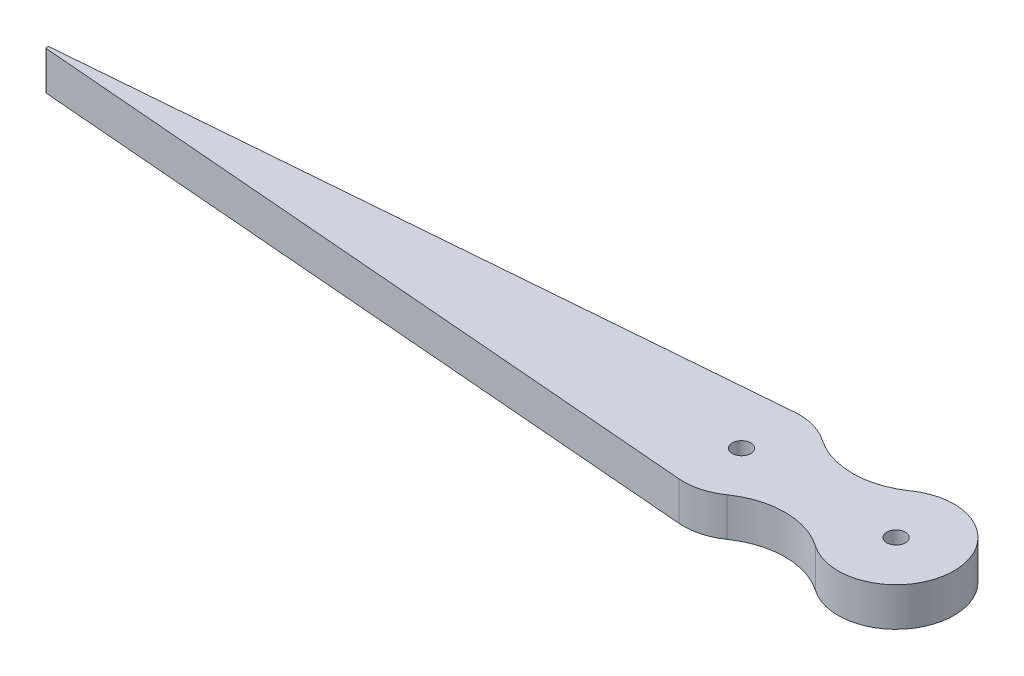
ISO-10303-21;
HEADER;
FILE_DESCRIPTION(('STEP AP214'),'2;1');
FILE_NAME('part.step','',(''),(''),'','','');
FILE_SCHEMA(('AUTOMOTIVE_DESIGN { 1 0 10303 214 1 1 1 1 }'));
ENDSEC;
DATA;
#1=APPLICATION_CONTEXT('core data for automotive mechanical design processes');
#2=APPLICATION_PROTOCOL_DEFINITION('international standard','automotive_design',2000,#1);
#3=PRODUCT_CONTEXT('',#1,'mechanical');
#4=PRODUCT('Part','Part','',(#3));
#5=PRODUCT_RELATED_PRODUCT_CATEGORY('part','',(#4));
#6=PRODUCT_DEFINITION_FORMATION('','',#4);
#7=PRODUCT_DEFINITION_CONTEXT('part definition',#1,'design');
#8=PRODUCT_DEFINITION('design','',#6,#7);
#9=PRODUCT_DEFINITION_SHAPE('','',#8);
#10=(LENGTH_UNIT() NAMED_UNIT(*) SI_UNIT(.MILLI.,.METRE.));
#11=(NAMED_UNIT(*) PLANE_ANGLE_UNIT() SI_UNIT($,.RADIAN.));
#12=(NAMED_UNIT(*) SI_UNIT($,.STERADIAN.) SOLID_ANGLE_UNIT());
#13=UNCERTAINTY_MEASURE_WITH_UNIT(LENGTH_MEASURE(1.E-05),#10,'distance_accuracy_value','');
#14=(GEOMETRIC_REPRESENTATION_CONTEXT(3) GLOBAL_UNCERTAINTY_ASSIGNED_CONTEXT((#13)) GLOBAL_UNIT_ASSIGNED_CONTEXT((#10,
#11,#12)) REPRESENTATION_CONTEXT('',''));
#15=CARTESIAN_POINT('',(0.,0.,0.));
#16=DIRECTION('',(0.,0.,1.));
#17=DIRECTION('',(1.,0.,0.));
#18=AXIS2_PLACEMENT_3D('',#15,#16,#17);
#19=CARTESIAN_POINT('',(0.,6.35,0.));
#20=DIRECTION('',(0.,1.,0.));
#21=DIRECTION('',(0.,0.,1.));
#22=AXIS2_PLACEMENT_3D('',#19,#20,#21);
#23=PLANE('',#22);
#24=CARTESIAN_POINT('',(0.,6.35,0.));
#25=DIRECTION('',(0.,1.,0.));
#26=DIRECTION('',(0.,0.,1.));
#27=AXIS2_PLACEMENT_3D('',#24,#25,#26);
#28=CIRCLE('',#27,1.524);
#29=CARTESIAN_POINT('',(0.,6.35,1.524));
#30=VERTEX_POINT('',#29);
#31=EDGE_CURVE('E150',#30,#30,#28,.T.);
#32=ORIENTED_EDGE('',*,*,#31,.F.);
#33=EDGE_LOOP('',(#32));
#34=FACE_BOUND('',#33,.T.);
#35=DIRECTION('',(-0.996685329508931,0.,0.081353266324555));
#36=VECTOR('',#35,1.);
#37=CARTESIAN_POINT('',(-0.774889861741387,6.35,-9.49342776357256));
#38=LINE('',#37,#36);
#39=CARTESIAN_POINT('',(-0.774889861741387,6.35,-9.49342776357256));
#40=VERTEX_POINT('',#39);
#41=CARTESIAN_POINT('',(-113.980439640964,6.35,-0.253158073695268));
#42=VERTEX_POINT('',#41);
#43=EDGE_CURVE('E95',#40,#42,#38,.T.);
#44=ORIENTED_EDGE('',*,*,#43,.T.);
#45=CARTESIAN_POINT('',(-113.959775911317,6.35,0.));
#46=DIRECTION('',(0.,1.,0.));
#47=DIRECTION('',(0.,0.,1.));
#48=AXIS2_PLACEMENT_3D('',#45,#46,#47);
#49=CIRCLE('',#48,0.254);
#50=CARTESIAN_POINT('',(-113.980439640964,6.35,0.253158073695268));
#51=VERTEX_POINT('',#50);
#52=EDGE_CURVE('E11',#42,#51,#49,.T.);
#53=ORIENTED_EDGE('',*,*,#52,.T.);
#54=DIRECTION('',(0.996685329508931,0.,0.081353266324555));
#55=VECTOR('',#54,1.);
#56=CARTESIAN_POINT('',(-117.081961552723,6.35,0.));
#57=LINE('',#56,#55);
#58=CARTESIAN_POINT('',(-0.774889861741387,6.35,9.49342776357256));
#59=VERTEX_POINT('',#58);
#60=EDGE_CURVE('E103',#51,#59,#57,.T.);
#61=ORIENTED_EDGE('',*,*,#60,.T.);
#62=CARTESIAN_POINT('',(0.,6.35,0.));
#63=DIRECTION('',(0.,1.,0.));
#64=DIRECTION('',(0.,0.,1.));
#65=AXIS2_PLACEMENT_3D('',#62,#63,#64);
#66=CIRCLE('',#65,9.525);
#67=CARTESIAN_POINT('',(5.44285714285714,6.35,7.81670845832496));
#68=VERTEX_POINT('',#67);
#69=EDGE_CURVE('E156',#59,#68,#66,.T.);
#70=ORIENTED_EDGE('',*,*,#69,.T.);
#71=CARTESIAN_POINT('',(12.7,6.35,18.2389864027582));
#72=DIRECTION('',(0.,-1.,0.));
#73=DIRECTION('',(0.,0.,1.));
#74=AXIS2_PLACEMENT_3D('',#71,#72,#73);
#75=CIRCLE('',#74,12.7);
#76=CARTESIAN_POINT('',(19.9571428571429,6.35,7.81670845832496));
#77=VERTEX_POINT('',#76);
#78=EDGE_CURVE('E154',#68,#77,#75,.T.);
#79=ORIENTED_EDGE('',*,*,#78,.T.);
#80=CARTESIAN_POINT('',(25.4,6.35,0.));
#81=DIRECTION('',(0.,1.,0.));
#82=DIRECTION('',(0.,0.,1.));
#83=AXIS2_PLACEMENT_3D('',#80,#81,#82);
#84=CIRCLE('',#83,9.525);
#85=CARTESIAN_POINT('',(19.9571428571429,6.35,-7.81670845832496));
#86=VERTEX_POINT('',#85);
#87=EDGE_CURVE('E152',#77,#86,#84,.T.);
#88=ORIENTED_EDGE('',*,*,#87,.T.);
#89=CARTESIAN_POINT('',(12.7,6.35,-18.2389864027582));
#90=DIRECTION('',(0.,-1.,0.));
#91=DIRECTION('',(0.,0.,1.));
#92=AXIS2_PLACEMENT_3D('',#89,#90,#91);
#93=CIRCLE('',#92,12.7);
#94=CARTESIAN_POINT('',(5.44285714285714,6.35,-7.81670845832496));
#95=VERTEX_POINT('',#94);
#96=EDGE_CURVE('E109',#86,#95,#93,.T.);
#97=ORIENTED_EDGE('',*,*,#96,.T.);
#98=CARTESIAN_POINT('',(0.,6.35,0.));
#99=DIRECTION('',(0.,1.,0.));
#100=DIRECTION('',(0.,0.,1.));
#101=AXIS2_PLACEMENT_3D('',#98,#99,#100);
#102=CIRCLE('',#101,9.525);
#103=EDGE_CURVE('E104',#95,#40,#102,.T.);
#104=ORIENTED_EDGE('',*,*,#103,.T.);
#105=EDGE_LOOP('',(#44,#53,#61,#70,#79,#88,#97,#104));
#106=FACE_BOUND('',#105,.T.);
#107=CARTESIAN_POINT('',(25.4,6.35,0.));
#108=DIRECTION('',(0.,1.,0.));
#109=DIRECTION('',(0.,0.,1.));
#110=AXIS2_PLACEMENT_3D('',#107,#108,#109);
#111=CIRCLE('',#110,1.524);
#112=CARTESIAN_POINT('',(25.4,6.35,1.524));
#113=VERTEX_POINT('',#112);
#114=EDGE_CURVE('E162',#113,#113,#111,.T.);
#115=ORIENTED_EDGE('',*,*,#114,.F.);
#116=EDGE_LOOP('',(#115));
#117=FACE_BOUND('',#116,.T.);
#118=ADVANCED_FACE('F34',(#34,#106,#117),#23,.T.);
#119=CARTESIAN_POINT('',(0.,0.,0.));
#120=DIRECTION('',(0.,1.,0.));
#121=DIRECTION('',(0.,0.,1.));
#122=AXIS2_PLACEMENT_3D('',#119,#120,#121);
#123=PLANE('',#122);
#124=DIRECTION('',(0.996685329508931,0.,0.081353266324555));
#125=VECTOR('',#124,1.);
#126=CARTESIAN_POINT('',(-117.081961552723,0.,0.));
#127=LINE('',#126,#125);
#128=CARTESIAN_POINT('',(-113.980439640964,0.,0.253158073695268));
#129=VERTEX_POINT('',#128);
#130=CARTESIAN_POINT('',(-0.774889861741387,0.,9.49342776357256));
#131=VERTEX_POINT('',#130);
#132=EDGE_CURVE('E145',#129,#131,#127,.T.);
#133=ORIENTED_EDGE('',*,*,#132,.F.);
#134=CARTESIAN_POINT('',(-113.959775911317,0.,0.));
#135=DIRECTION('',(0.,1.,0.));
#136=DIRECTION('',(0.,0.,1.));
#137=AXIS2_PLACEMENT_3D('',#134,#135,#136);
#138=CIRCLE('',#137,0.254);
#139=CARTESIAN_POINT('',(-113.980439640964,0.,-0.253158073695268));
#140=VERTEX_POINT('',#139);
#141=EDGE_CURVE('E56',#129,#140,#138,.F.);
#142=ORIENTED_EDGE('',*,*,#141,.T.);
#143=DIRECTION('',(-0.996685329508931,0.,0.081353266324555));
#144=VECTOR('',#143,1.);
#145=CARTESIAN_POINT('',(-0.774889861741387,0.,-9.49342776357256));
#146=LINE('',#145,#144);
#147=CARTESIAN_POINT('',(-0.774889861741387,0.,-9.49342776357256));
#148=VERTEX_POINT('',#147);
#149=EDGE_CURVE('E147',#148,#140,#146,.T.);
#150=ORIENTED_EDGE('',*,*,#149,.F.);
#151=CARTESIAN_POINT('',(0.,0.,0.));
#152=DIRECTION('',(0.,1.,0.));
#153=DIRECTION('',(0.,0.,1.));
#154=AXIS2_PLACEMENT_3D('',#151,#152,#153);
#155=CIRCLE('',#154,9.525);
#156=CARTESIAN_POINT('',(5.44285714285714,0.,-7.81670845832496));
#157=VERTEX_POINT('',#156);
#158=EDGE_CURVE('E117',#157,#148,#155,.T.);
#159=ORIENTED_EDGE('',*,*,#158,.F.);
#160=CARTESIAN_POINT('',(12.7,0.,-18.2389864027582));
#161=DIRECTION('',(0.,-1.,0.));
#162=DIRECTION('',(0.,0.,1.));
#163=AXIS2_PLACEMENT_3D('',#160,#161,#162);
#164=CIRCLE('',#163,12.7);
#165=CARTESIAN_POINT('',(19.9571428571429,0.,-7.81670845832496));
#166=VERTEX_POINT('',#165);
#167=EDGE_CURVE('E113',#166,#157,#164,.T.);
#168=ORIENTED_EDGE('',*,*,#167,.F.);
#169=CARTESIAN_POINT('',(25.4,0.,0.));
#170=DIRECTION('',(0.,1.,0.));
#171=DIRECTION('',(0.,0.,1.));
#172=AXIS2_PLACEMENT_3D('',#169,#170,#171);
#173=CIRCLE('',#172,9.525);
#174=CARTESIAN_POINT('',(19.9571428571429,0.,7.81670845832496));
#175=VERTEX_POINT('',#174);
#176=EDGE_CURVE('E139',#175,#166,#173,.T.);
#177=ORIENTED_EDGE('',*,*,#176,.F.);
#178=CARTESIAN_POINT('',(12.7,0.,18.2389864027582));
#179=DIRECTION('',(0.,-1.,0.));
#180=DIRECTION('',(0.,0.,1.));
#181=AXIS2_PLACEMENT_3D('',#178,#179,#180);
#182=CIRCLE('',#181,12.7);
#183=CARTESIAN_POINT('',(5.44285714285714,0.,7.81670845832496));
#184=VERTEX_POINT('',#183);
#185=EDGE_CURVE('E141',#184,#175,#182,.T.);
#186=ORIENTED_EDGE('',*,*,#185,.F.);
#187=CARTESIAN_POINT('',(0.,0.,0.));
#188=DIRECTION('',(0.,1.,0.));
#189=DIRECTION('',(0.,0.,1.));
#190=AXIS2_PLACEMENT_3D('',#187,#188,#189);
#191=CIRCLE('',#190,9.525);
#192=EDGE_CURVE('E143',#131,#184,#191,.T.);
#193=ORIENTED_EDGE('',*,*,#192,.F.);
#194=EDGE_LOOP('',(#133,#142,#150,#159,#168,#177,#186,#193));
#195=FACE_BOUND('',#194,.T.);
#196=CARTESIAN_POINT('',(0.,0.,0.));
#197=DIRECTION('',(0.,1.,0.));
#198=DIRECTION('',(0.,0.,1.));
#199=AXIS2_PLACEMENT_3D('',#196,#197,#198);
#200=CIRCLE('',#199,1.524);
#201=CARTESIAN_POINT('',(0.,0.,1.524));
#202=VERTEX_POINT('',#201);
#203=EDGE_CURVE('E159',#202,#202,#200,.T.);
#204=ORIENTED_EDGE('',*,*,#203,.T.);
#205=EDGE_LOOP('',(#204));
#206=FACE_BOUND('',#205,.T.);
#207=CARTESIAN_POINT('',(25.4,0.,0.));
#208=DIRECTION('',(0.,1.,0.));
#209=DIRECTION('',(0.,0.,1.));
#210=AXIS2_PLACEMENT_3D('',#207,#208,#209);
#211=CIRCLE('',#210,1.524);
#212=CARTESIAN_POINT('',(25.4,0.,1.524));
#213=VERTEX_POINT('',#212);
#214=EDGE_CURVE('E165',#213,#213,#211,.T.);
#215=ORIENTED_EDGE('',*,*,#214,.T.);
#216=EDGE_LOOP('',(#215));
#217=FACE_BOUND('',#216,.T.);
#218=ADVANCED_FACE('F174',(#195,#206,#217),#123,.F.);
#219=CARTESIAN_POINT('',(0.,6.35,0.));
#220=DIRECTION('',(0.,-1.,0.));
#221=DIRECTION('',(0.,0.,-1.));
#222=AXIS2_PLACEMENT_3D('',#219,#220,#221);
#223=CYLINDRICAL_SURFACE('',#222,9.525);
#224=ORIENTED_EDGE('',*,*,#158,.T.);
#225=DIRECTION('',(0.,-1.,0.));
#226=VECTOR('',#225,1.);
#227=CARTESIAN_POINT('',(-0.774889861741387,6.35,-9.49342776357256));
#228=LINE('',#227,#226);
#229=EDGE_CURVE('E99',#40,#148,#228,.T.);
#230=ORIENTED_EDGE('',*,*,#229,.F.);
#231=ORIENTED_EDGE('',*,*,#103,.F.);
#232=DIRECTION('',(0.,-1.,0.));
#233=VECTOR('',#232,1.);
#234=CARTESIAN_POINT('',(5.44285714285714,6.35,-7.81670845832496));
#235=LINE('',#234,#233);
#236=EDGE_CURVE('E136',#95,#157,#235,.T.);
#237=ORIENTED_EDGE('',*,*,#236,.T.);
#238=EDGE_LOOP('',(#224,#230,#231,#237));
#239=FACE_BOUND('',#238,.T.);
#240=ADVANCED_FACE('F115',(#239),#223,.T.);
#241=CARTESIAN_POINT('',(-0.774889861741387,6.35,-9.49342776357256));
#242=DIRECTION('',(0.081353266324555,0.,0.996685329508931));
#243=DIRECTION('',(0.996685329508931,0.,-0.081353266324555));
#244=AXIS2_PLACEMENT_3D('',#241,#242,#243);
#245=PLANE('',#244);
#246=ORIENTED_EDGE('',*,*,#149,.T.);
#247=DIRECTION('',(0.,-1.,0.));
#248=VECTOR('',#247,1.);
#249=CARTESIAN_POINT('',(-113.980439640964,6.35,-0.253158073695268));
#250=LINE('',#249,#248);
#251=EDGE_CURVE('E42',#140,#42,#250,.F.);
#252=ORIENTED_EDGE('',*,*,#251,.T.);
#253=ORIENTED_EDGE('',*,*,#43,.F.);
#254=ORIENTED_EDGE('',*,*,#229,.T.);
#255=EDGE_LOOP('',(#246,#252,#253,#254));
#256=FACE_BOUND('',#255,.T.);
#257=ADVANCED_FACE('F97',(#256),#245,.F.);
#258=CARTESIAN_POINT('',(-117.081961552723,6.35,0.));
#259=DIRECTION('',(0.081353266324555,0.,-0.996685329508931));
#260=DIRECTION('',(-0.996685329508931,0.,-0.081353266324555));
#261=AXIS2_PLACEMENT_3D('',#258,#259,#260);
#262=PLANE('',#261);
#263=ORIENTED_EDGE('',*,*,#60,.F.);
#264=DIRECTION('',(0.,-1.,0.));
#265=VECTOR('',#264,1.);
#266=CARTESIAN_POINT('',(-113.980439640964,6.35,0.253158073695268));
#267=LINE('',#266,#265);
#268=EDGE_CURVE('E118',#51,#129,#267,.T.);
#269=ORIENTED_EDGE('',*,*,#268,.T.);
#270=ORIENTED_EDGE('',*,*,#132,.T.);
#271=DIRECTION('',(0.,-1.,0.));
#272=VECTOR('',#271,1.);
#273=CARTESIAN_POINT('',(-0.774889861741387,6.35,9.49342776357256));
#274=LINE('',#273,#272);
#275=EDGE_CURVE('E119',#59,#131,#274,.T.);
#276=ORIENTED_EDGE('',*,*,#275,.F.);
#277=EDGE_LOOP('',(#263,#269,#270,#276));
#278=FACE_BOUND('',#277,.T.);
#279=ADVANCED_FACE('F201',(#278),#262,.F.);
#280=CARTESIAN_POINT('',(0.,6.35,0.));
#281=DIRECTION('',(0.,-1.,0.));
#282=DIRECTION('',(0.,0.,-1.));
#283=AXIS2_PLACEMENT_3D('',#280,#281,#282);
#284=CYLINDRICAL_SURFACE('',#283,9.525);
#285=ORIENTED_EDGE('',*,*,#192,.T.);
#286=DIRECTION('',(0.,-1.,0.));
#287=VECTOR('',#286,1.);
#288=CARTESIAN_POINT('',(5.44285714285714,6.35,7.81670845832496));
#289=LINE('',#288,#287);
#290=EDGE_CURVE('E124',#68,#184,#289,.T.);
#291=ORIENTED_EDGE('',*,*,#290,.F.);
#292=ORIENTED_EDGE('',*,*,#69,.F.);
#293=ORIENTED_EDGE('',*,*,#275,.T.);
#294=EDGE_LOOP('',(#285,#291,#292,#293));
#295=FACE_BOUND('',#294,.T.);
#296=ADVANCED_FACE('F197',(#295),#284,.T.);
#297=CARTESIAN_POINT('',(12.7,6.35,18.2389864027582));
#298=DIRECTION('',(0.,-1.,0.));
#299=DIRECTION('',(0.,0.,-1.));
#300=AXIS2_PLACEMENT_3D('',#297,#298,#299);
#301=CYLINDRICAL_SURFACE('',#300,12.7);
#302=ORIENTED_EDGE('',*,*,#185,.T.);
#303=DIRECTION('',(0.,-1.,0.));
#304=VECTOR('',#303,1.);
#305=CARTESIAN_POINT('',(19.9571428571429,6.35,7.81670845832496));
#306=LINE('',#305,#304);
#307=EDGE_CURVE('E130',#77,#175,#306,.T.);
#308=ORIENTED_EDGE('',*,*,#307,.F.);
#309=ORIENTED_EDGE('',*,*,#78,.F.);
#310=ORIENTED_EDGE('',*,*,#290,.T.);
#311=EDGE_LOOP('',(#302,#308,#309,#310));
#312=FACE_BOUND('',#311,.T.);
#313=ADVANCED_FACE('F193',(#312),#301,.F.);
#314=CARTESIAN_POINT('',(25.4,6.35,0.));
#315=DIRECTION('',(0.,-1.,0.));
#316=DIRECTION('',(0.,0.,-1.));
#317=AXIS2_PLACEMENT_3D('',#314,#315,#316);
#318=CYLINDRICAL_SURFACE('',#317,9.525);
#319=ORIENTED_EDGE('',*,*,#176,.T.);
#320=DIRECTION('',(0.,-1.,0.));
#321=VECTOR('',#320,1.);
#322=CARTESIAN_POINT('',(19.9571428571429,6.35,-7.81670845832496));
#323=LINE('',#322,#321);
#324=EDGE_CURVE('E133',#86,#166,#323,.T.);
#325=ORIENTED_EDGE('',*,*,#324,.F.);
#326=ORIENTED_EDGE('',*,*,#87,.F.);
#327=ORIENTED_EDGE('',*,*,#307,.T.);
#328=EDGE_LOOP('',(#319,#325,#326,#327));
#329=FACE_BOUND('',#328,.T.);
#330=ADVANCED_FACE('F189',(#329),#318,.T.);
#331=CARTESIAN_POINT('',(12.7,6.35,-18.2389864027582));
#332=DIRECTION('',(0.,-1.,0.));
#333=DIRECTION('',(0.,0.,-1.));
#334=AXIS2_PLACEMENT_3D('',#331,#332,#333);
#335=CYLINDRICAL_SURFACE('',#334,12.7);
#336=ORIENTED_EDGE('',*,*,#167,.T.);
#337=ORIENTED_EDGE('',*,*,#236,.F.);
#338=ORIENTED_EDGE('',*,*,#96,.F.);
#339=ORIENTED_EDGE('',*,*,#324,.T.);
#340=EDGE_LOOP('',(#336,#337,#338,#339));
#341=FACE_BOUND('',#340,.T.);
#342=ADVANCED_FACE('F186',(#341),#335,.F.);
#343=CARTESIAN_POINT('',(0.,6.35,0.));
#344=DIRECTION('',(0.,-1.,0.));
#345=DIRECTION('',(0.,0.,-1.));
#346=AXIS2_PLACEMENT_3D('',#343,#344,#345);
#347=CYLINDRICAL_SURFACE('',#346,1.524);
#348=ORIENTED_EDGE('',*,*,#31,.T.);
#349=EDGE_LOOP('',(#348));
#350=FACE_BOUND('',#349,.T.);
#351=ORIENTED_EDGE('',*,*,#203,.F.);
#352=EDGE_LOOP('',(#351));
#353=FACE_BOUND('',#352,.T.);
#354=ADVANCED_FACE('F183',(#350,#353),#347,.F.);
#355=CARTESIAN_POINT('',(25.4,6.35,0.));
#356=DIRECTION('',(0.,-1.,0.));
#357=DIRECTION('',(0.,0.,-1.));
#358=AXIS2_PLACEMENT_3D('',#355,#356,#357);
#359=CYLINDRICAL_SURFACE('',#358,1.524);
#360=ORIENTED_EDGE('',*,*,#114,.T.);
#361=EDGE_LOOP('',(#360));
#362=FACE_BOUND('',#361,.T.);
#363=ORIENTED_EDGE('',*,*,#214,.F.);
#364=EDGE_LOOP('',(#363));
#365=FACE_BOUND('',#364,.T.);
#366=ADVANCED_FACE('F171',(#362,#365),#359,.F.);
#367=CARTESIAN_POINT('',(-113.959775911317,6.35,0.));
#368=DIRECTION('',(0.,-1.,0.));
#369=DIRECTION('',(0.,0.,-1.));
#370=AXIS2_PLACEMENT_3D('',#367,#368,#369);
#371=CYLINDRICAL_SURFACE('',#370,0.254);
#372=ORIENTED_EDGE('',*,*,#52,.F.);
#373=ORIENTED_EDGE('',*,*,#251,.F.);
#374=ORIENTED_EDGE('',*,*,#141,.F.);
#375=ORIENTED_EDGE('',*,*,#268,.F.);
#376=EDGE_LOOP('',(#372,#373,#374,#375));
#377=FACE_BOUND('',#376,.T.);
#378=ADVANCED_FACE('F36',(#377),#371,.T.);
#379=CLOSED_SHELL('',(#118,#218,#240,#257,#279,#296,#313,#330,#342,#354,#366,#378));
#380=MANIFOLD_SOLID_BREP('B2',#379);
#381=ADVANCED_BREP_SHAPE_REPRESENTATION('',(#18,#380),#14);
#382=SHAPE_DEFINITION_REPRESENTATION(#9,#381);
ENDSEC;
END-ISO-10303-21;
